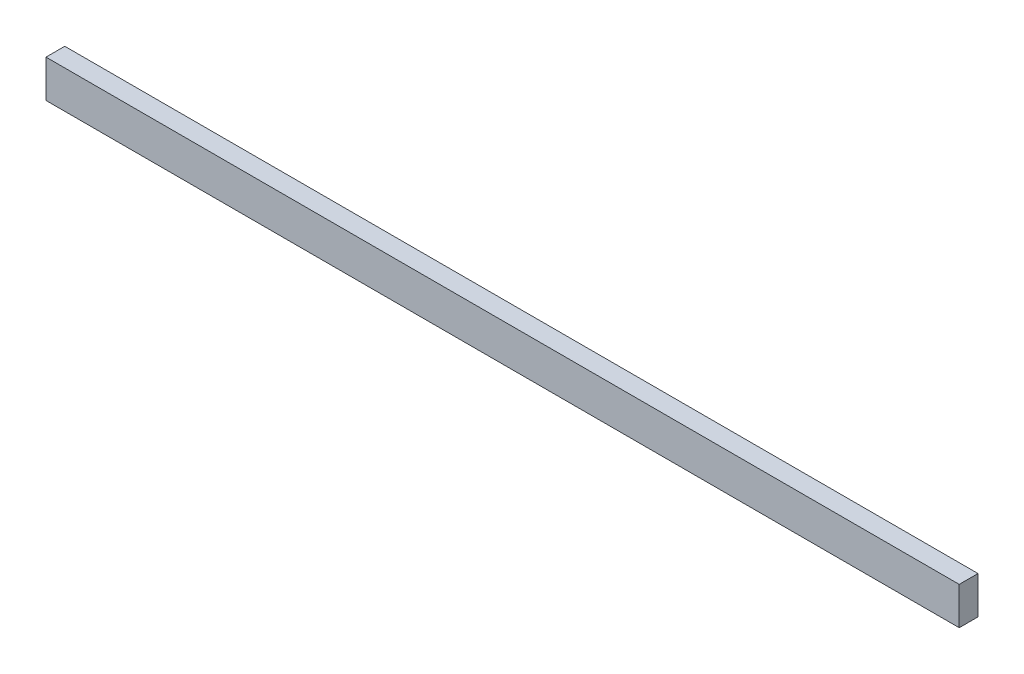
ISO-10303-21;
HEADER;
FILE_DESCRIPTION(('STEP AP214'),'2;1');
FILE_NAME('part.step','',(''),(''),'','','');
FILE_SCHEMA(('AUTOMOTIVE_DESIGN { 1 0 10303 214 1 1 1 1 }'));
ENDSEC;
DATA;
#1=APPLICATION_CONTEXT('core data for automotive mechanical design processes');
#2=APPLICATION_PROTOCOL_DEFINITION('international standard','automotive_design',2000,#1);
#3=PRODUCT_CONTEXT('',#1,'mechanical');
#4=PRODUCT('Part','Part','',(#3));
#5=PRODUCT_RELATED_PRODUCT_CATEGORY('part','',(#4));
#6=PRODUCT_DEFINITION_FORMATION('','',#4);
#7=PRODUCT_DEFINITION_CONTEXT('part definition',#1,'design');
#8=PRODUCT_DEFINITION('design','',#6,#7);
#9=PRODUCT_DEFINITION_SHAPE('','',#8);
#10=(LENGTH_UNIT() NAMED_UNIT(*) SI_UNIT(.MILLI.,.METRE.));
#11=(NAMED_UNIT(*) PLANE_ANGLE_UNIT() SI_UNIT($,.RADIAN.));
#12=(NAMED_UNIT(*) SI_UNIT($,.STERADIAN.) SOLID_ANGLE_UNIT());
#13=UNCERTAINTY_MEASURE_WITH_UNIT(LENGTH_MEASURE(1.E-05),#10,'distance_accuracy_value','');
#14=(GEOMETRIC_REPRESENTATION_CONTEXT(3) GLOBAL_UNCERTAINTY_ASSIGNED_CONTEXT((#13)) GLOBAL_UNIT_ASSIGNED_CONTEXT((#10,
#11,#12)) REPRESENTATION_CONTEXT('',''));
#15=CARTESIAN_POINT('',(0.,0.,0.));
#16=DIRECTION('',(0.,0.,1.));
#17=DIRECTION('',(1.,0.,0.));
#18=AXIS2_PLACEMENT_3D('',#15,#16,#17);
#19=CARTESIAN_POINT('',(0.,50.7999999999968,0.));
#20=DIRECTION('',(-1.,0.,0.));
#21=DIRECTION('',(0.,0.,0.999999999999999));
#22=AXIS2_PLACEMENT_3D('',#19,#20,#21);
#23=PLANE('',#22);
#24=DIRECTION('',(0.,0.,-0.999999999999999));
#25=VECTOR('',#24,1.);
#26=CARTESIAN_POINT('',(0.,0.,0.));
#27=LINE('',#26,#25);
#28=CARTESIAN_POINT('',(0.,0.,0.));
#29=VERTEX_POINT('',#28);
#30=CARTESIAN_POINT('',(0.,0.,-25.4000000000001));
#31=VERTEX_POINT('',#30);
#32=EDGE_CURVE('E99',#29,#31,#27,.T.);
#33=ORIENTED_EDGE('',*,*,#32,.F.);
#34=DIRECTION('',(0.,-1.,0.));
#35=VECTOR('',#34,1.);
#36=CARTESIAN_POINT('',(0.,50.7999999999968,0.));
#37=LINE('',#36,#35);
#38=CARTESIAN_POINT('',(0.,50.7999999999968,0.));
#39=VERTEX_POINT('',#38);
#40=EDGE_CURVE('E11',#39,#29,#37,.T.);
#41=ORIENTED_EDGE('',*,*,#40,.F.);
#42=DIRECTION('',(0.,0.,-0.999999999999999));
#43=VECTOR('',#42,1.);
#44=CARTESIAN_POINT('',(0.,50.7999999999968,0.));
#45=LINE('',#44,#43);
#46=CARTESIAN_POINT('',(0.,50.7999999999968,-25.4000000000001));
#47=VERTEX_POINT('',#46);
#48=EDGE_CURVE('E94',#39,#47,#45,.T.);
#49=ORIENTED_EDGE('',*,*,#48,.T.);
#50=DIRECTION('',(0.,-1.,0.));
#51=VECTOR('',#50,1.);
#52=CARTESIAN_POINT('',(0.,50.7999999999968,-25.4000000000001));
#53=LINE('',#52,#51);
#54=EDGE_CURVE('E37',#47,#31,#53,.T.);
#55=ORIENTED_EDGE('',*,*,#54,.T.);
#56=EDGE_LOOP('',(#33,#41,#49,#55));
#57=FACE_BOUND('',#56,.T.);
#58=ADVANCED_FACE('F34',(#57),#23,.T.);
#59=CARTESIAN_POINT('',(0.,50.7999999999968,0.));
#60=DIRECTION('',(0.,0.,-0.999999999999999));
#61=DIRECTION('',(-1.,0.,0.));
#62=AXIS2_PLACEMENT_3D('',#59,#60,#61);
#63=PLANE('',#62);
#64=DIRECTION('',(1.,0.,0.));
#65=VECTOR('',#64,1.);
#66=CARTESIAN_POINT('',(0.,0.,0.));
#67=LINE('',#66,#65);
#68=CARTESIAN_POINT('',(1234.94081672119,-1.99840144432528E-12,0.));
#69=VERTEX_POINT('',#68);
#70=EDGE_CURVE('E67',#29,#69,#67,.T.);
#71=ORIENTED_EDGE('',*,*,#70,.T.);
#72=DIRECTION('',(0.,-1.,0.));
#73=VECTOR('',#72,1.);
#74=CARTESIAN_POINT('',(1234.94081672119,50.7999999999964,0.));
#75=LINE('',#74,#73);
#76=CARTESIAN_POINT('',(1234.94081672119,50.7999999999964,0.));
#77=VERTEX_POINT('',#76);
#78=EDGE_CURVE('E43',#77,#69,#75,.T.);
#79=ORIENTED_EDGE('',*,*,#78,.F.);
#80=DIRECTION('',(1.,0.,0.));
#81=VECTOR('',#80,1.);
#82=CARTESIAN_POINT('',(0.,50.7999999999968,0.));
#83=LINE('',#82,#81);
#84=EDGE_CURVE('E84',#39,#77,#83,.T.);
#85=ORIENTED_EDGE('',*,*,#84,.F.);
#86=ORIENTED_EDGE('',*,*,#40,.T.);
#87=EDGE_LOOP('',(#71,#79,#85,#86));
#88=FACE_BOUND('',#87,.T.);
#89=ADVANCED_FACE('F109',(#88),#63,.F.);
#90=CARTESIAN_POINT('',(1234.94081672119,50.7999999999964,0.));
#91=DIRECTION('',(-1.,0.,0.));
#92=DIRECTION('',(0.,0.,0.999999999999999));
#93=AXIS2_PLACEMENT_3D('',#90,#91,#92);
#94=PLANE('',#93);
#95=DIRECTION('',(0.,0.,-0.999999999999999));
#96=VECTOR('',#95,1.);
#97=CARTESIAN_POINT('',(1234.94081672119,-1.99840144432528E-12,0.));
#98=LINE('',#97,#96);
#99=CARTESIAN_POINT('',(1234.94081672119,-1.99840144432528E-12,-25.4000000000001));
#100=VERTEX_POINT('',#99);
#101=EDGE_CURVE('E91',#69,#100,#98,.T.);
#102=ORIENTED_EDGE('',*,*,#101,.T.);
#103=DIRECTION('',(0.,-1.,0.));
#104=VECTOR('',#103,1.);
#105=CARTESIAN_POINT('',(1234.94081672119,50.7999999999964,-25.4000000000001));
#106=LINE('',#105,#104);
#107=CARTESIAN_POINT('',(1234.94081672119,50.7999999999964,-25.4000000000001));
#108=VERTEX_POINT('',#107);
#109=EDGE_CURVE('E88',#108,#100,#106,.T.);
#110=ORIENTED_EDGE('',*,*,#109,.F.);
#111=DIRECTION('',(0.,0.,-0.999999999999999));
#112=VECTOR('',#111,1.);
#113=CARTESIAN_POINT('',(1234.94081672119,50.7999999999964,0.));
#114=LINE('',#113,#112);
#115=EDGE_CURVE('E79',#77,#108,#114,.T.);
#116=ORIENTED_EDGE('',*,*,#115,.F.);
#117=ORIENTED_EDGE('',*,*,#78,.T.);
#118=EDGE_LOOP('',(#102,#110,#116,#117));
#119=FACE_BOUND('',#118,.T.);
#120=ADVANCED_FACE('F89',(#119),#94,.F.);
#121=CARTESIAN_POINT('',(0.,50.7999999999968,-25.4000000000001));
#122=DIRECTION('',(0.,0.,-0.999999999999999));
#123=DIRECTION('',(-1.,0.,0.));
#124=AXIS2_PLACEMENT_3D('',#121,#122,#123);
#125=PLANE('',#124);
#126=DIRECTION('',(1.,0.,0.));
#127=VECTOR('',#126,1.);
#128=CARTESIAN_POINT('',(0.,0.,-25.4000000000001));
#129=LINE('',#128,#127);
#130=EDGE_CURVE('E102',#31,#100,#129,.T.);
#131=ORIENTED_EDGE('',*,*,#130,.F.);
#132=ORIENTED_EDGE('',*,*,#54,.F.);
#133=DIRECTION('',(1.,0.,0.));
#134=VECTOR('',#133,1.);
#135=CARTESIAN_POINT('',(0.,50.7999999999968,-25.4000000000001));
#136=LINE('',#135,#134);
#137=EDGE_CURVE('E83',#47,#108,#136,.T.);
#138=ORIENTED_EDGE('',*,*,#137,.T.);
#139=ORIENTED_EDGE('',*,*,#109,.T.);
#140=EDGE_LOOP('',(#131,#132,#138,#139));
#141=FACE_BOUND('',#140,.T.);
#142=ADVANCED_FACE('F93',(#141),#125,.T.);
#143=CARTESIAN_POINT('',(0.,50.7999999999968,0.));
#144=DIRECTION('',(0.,-1.,0.));
#145=DIRECTION('',(0.,0.,-0.999999999999999));
#146=AXIS2_PLACEMENT_3D('',#143,#144,#145);
#147=PLANE('',#146);
#148=ORIENTED_EDGE('',*,*,#48,.F.);
#149=ORIENTED_EDGE('',*,*,#84,.T.);
#150=ORIENTED_EDGE('',*,*,#115,.T.);
#151=ORIENTED_EDGE('',*,*,#137,.F.);
#152=EDGE_LOOP('',(#148,#149,#150,#151));
#153=FACE_BOUND('',#152,.T.);
#154=ADVANCED_FACE('F82',(#153),#147,.F.);
#155=CARTESIAN_POINT('',(0.,0.,0.));
#156=DIRECTION('',(0.,-1.,0.));
#157=DIRECTION('',(0.,0.,-0.999999999999999));
#158=AXIS2_PLACEMENT_3D('',#155,#156,#157);
#159=PLANE('',#158);
#160=ORIENTED_EDGE('',*,*,#32,.T.);
#161=ORIENTED_EDGE('',*,*,#130,.T.);
#162=ORIENTED_EDGE('',*,*,#101,.F.);
#163=ORIENTED_EDGE('',*,*,#70,.F.);
#164=EDGE_LOOP('',(#160,#161,#162,#163));
#165=FACE_BOUND('',#164,.T.);
#166=ADVANCED_FACE('F107',(#165),#159,.T.);
#167=CLOSED_SHELL('',(#58,#89,#120,#142,#154,#166));
#168=MANIFOLD_SOLID_BREP('B2',#167);
#169=ADVANCED_BREP_SHAPE_REPRESENTATION('',(#18,#168),#14);
#170=SHAPE_DEFINITION_REPRESENTATION(#9,#169);
ENDSEC;
END-ISO-10303-21;
